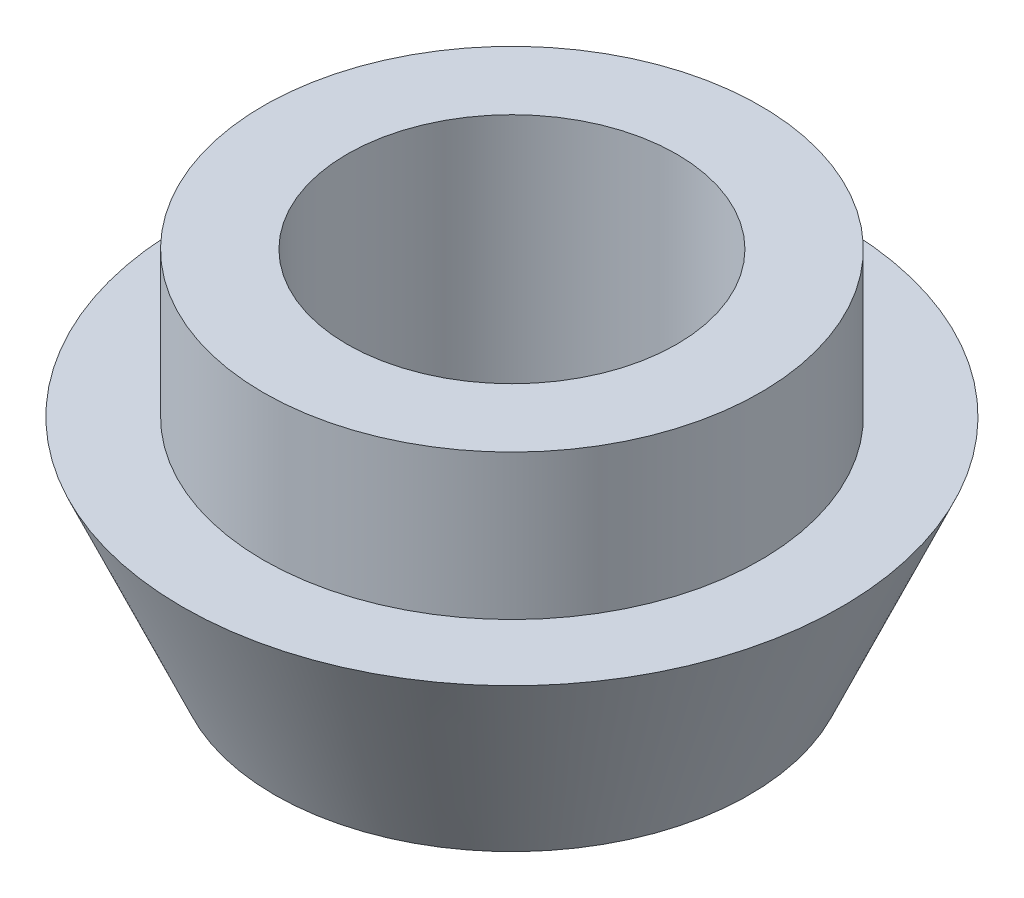
ISO-10303-21;
HEADER;
FILE_DESCRIPTION(('STEP AP214'),'2;1');
FILE_NAME('part.step','',(''),(''),'','','');
FILE_SCHEMA(('AUTOMOTIVE_DESIGN { 1 0 10303 214 1 1 1 1 }'));
ENDSEC;
DATA;
#1=APPLICATION_CONTEXT('core data for automotive mechanical design processes');
#2=APPLICATION_PROTOCOL_DEFINITION('international standard','automotive_design',2000,#1);
#3=PRODUCT_CONTEXT('',#1,'mechanical');
#4=PRODUCT('Part','Part','',(#3));
#5=PRODUCT_RELATED_PRODUCT_CATEGORY('part','',(#4));
#6=PRODUCT_DEFINITION_FORMATION('','',#4);
#7=PRODUCT_DEFINITION_CONTEXT('part definition',#1,'design');
#8=PRODUCT_DEFINITION('design','',#6,#7);
#9=PRODUCT_DEFINITION_SHAPE('','',#8);
#10=(LENGTH_UNIT() NAMED_UNIT(*) SI_UNIT(.MILLI.,.METRE.));
#11=(NAMED_UNIT(*) PLANE_ANGLE_UNIT() SI_UNIT($,.RADIAN.));
#12=(NAMED_UNIT(*) SI_UNIT($,.STERADIAN.) SOLID_ANGLE_UNIT());
#13=UNCERTAINTY_MEASURE_WITH_UNIT(LENGTH_MEASURE(1.E-05),#10,'distance_accuracy_value','');
#14=(GEOMETRIC_REPRESENTATION_CONTEXT(3) GLOBAL_UNCERTAINTY_ASSIGNED_CONTEXT((#13)) GLOBAL_UNIT_ASSIGNED_CONTEXT((#10,
#11,#12)) REPRESENTATION_CONTEXT('',''));
#15=CARTESIAN_POINT('',(0.,0.,0.));
#16=DIRECTION('',(0.,0.,1.));
#17=DIRECTION('',(1.,0.,0.));
#18=AXIS2_PLACEMENT_3D('',#15,#16,#17);
#19=CARTESIAN_POINT('',(4.572,0.,0.));
#20=DIRECTION('',(0.,-1.,0.));
#21=DIRECTION('',(0.,0.,1.));
#22=AXIS2_PLACEMENT_3D('',#19,#20,#21);
#23=PLANE('',#22);
#24=CARTESIAN_POINT('',(0.,0.,0.));
#25=DIRECTION('',(0.,1.,0.));
#26=DIRECTION('',(0.,0.,1.));
#27=AXIS2_PLACEMENT_3D('',#24,#25,#26);
#28=CIRCLE('',#27,4.572);
#29=CARTESIAN_POINT('',(0.,0.,4.572));
#30=VERTEX_POINT('',#29);
#31=EDGE_CURVE('E52',#30,#30,#28,.T.);
#32=ORIENTED_EDGE('',*,*,#31,.F.);
#33=EDGE_LOOP('',(#32));
#34=FACE_BOUND('',#33,.T.);
#35=CARTESIAN_POINT('',(0.,0.,0.));
#36=DIRECTION('',(0.,1.,0.));
#37=DIRECTION('',(0.,0.,1.));
#38=AXIS2_PLACEMENT_3D('',#35,#36,#37);
#39=CIRCLE('',#38,3.175);
#40=CARTESIAN_POINT('',(0.,0.,3.175));
#41=VERTEX_POINT('',#40);
#42=EDGE_CURVE('E10',#41,#41,#39,.T.);
#43=ORIENTED_EDGE('',*,*,#42,.T.);
#44=EDGE_LOOP('',(#43));
#45=FACE_BOUND('',#44,.T.);
#46=ADVANCED_FACE('F30',(#34,#45),#23,.T.);
#47=CARTESIAN_POINT('',(0.,-15.0878609773988,0.));
#48=DIRECTION('',(0.,-1.,0.));
#49=DIRECTION('',(0.,0.,1.));
#50=AXIS2_PLACEMENT_3D('',#47,#48,#49);
#51=CYLINDRICAL_SURFACE('',#50,3.175);
#52=ORIENTED_EDGE('',*,*,#42,.F.);
#53=EDGE_LOOP('',(#52));
#54=FACE_BOUND('',#53,.T.);
#55=CARTESIAN_POINT('',(0.,6.8199,0.));
#56=DIRECTION('',(0.,1.,0.));
#57=DIRECTION('',(0.,0.,1.));
#58=AXIS2_PLACEMENT_3D('',#55,#56,#57);
#59=CIRCLE('',#58,3.175);
#60=CARTESIAN_POINT('',(0.,6.8199,3.175));
#61=VERTEX_POINT('',#60);
#62=EDGE_CURVE('E36',#61,#61,#59,.T.);
#63=ORIENTED_EDGE('',*,*,#62,.T.);
#64=EDGE_LOOP('',(#63));
#65=FACE_BOUND('',#64,.T.);
#66=ADVANCED_FACE('F59',(#54,#65),#51,.F.);
#67=CARTESIAN_POINT('',(3.96875,6.8199,0.));
#68=DIRECTION('',(0.,1.,0.));
#69=DIRECTION('',(0.,0.,-1.));
#70=AXIS2_PLACEMENT_3D('',#67,#68,#69);
#71=PLANE('',#70);
#72=ORIENTED_EDGE('',*,*,#62,.F.);
#73=EDGE_LOOP('',(#72));
#74=FACE_BOUND('',#73,.T.);
#75=CARTESIAN_POINT('',(0.,6.8199,0.));
#76=DIRECTION('',(0.,1.,0.));
#77=DIRECTION('',(0.,0.,1.));
#78=AXIS2_PLACEMENT_3D('',#75,#76,#77);
#79=CIRCLE('',#78,4.7879);
#80=CARTESIAN_POINT('',(0.,6.8199,4.7879));
#81=VERTEX_POINT('',#80);
#82=EDGE_CURVE('E40',#81,#81,#79,.T.);
#83=ORIENTED_EDGE('',*,*,#82,.T.);
#84=EDGE_LOOP('',(#83));
#85=FACE_BOUND('',#84,.T.);
#86=ADVANCED_FACE('F63',(#74,#85),#71,.T.);
#87=CARTESIAN_POINT('',(0.,-15.0878609773988,0.));
#88=DIRECTION('',(0.,-1.,0.));
#89=DIRECTION('',(0.,0.,1.));
#90=AXIS2_PLACEMENT_3D('',#87,#88,#89);
#91=CYLINDRICAL_SURFACE('',#90,4.7879);
#92=ORIENTED_EDGE('',*,*,#82,.F.);
#93=EDGE_LOOP('',(#92));
#94=FACE_BOUND('',#93,.T.);
#95=CARTESIAN_POINT('',(0.,4.0259,0.));
#96=DIRECTION('',(0.,1.,0.));
#97=DIRECTION('',(0.,0.,1.));
#98=AXIS2_PLACEMENT_3D('',#95,#96,#97);
#99=CIRCLE('',#98,4.7879);
#100=CARTESIAN_POINT('',(0.,4.0259,4.7879));
#101=VERTEX_POINT('',#100);
#102=EDGE_CURVE('E44',#101,#101,#99,.T.);
#103=ORIENTED_EDGE('',*,*,#102,.T.);
#104=EDGE_LOOP('',(#103));
#105=FACE_BOUND('',#104,.T.);
#106=ADVANCED_FACE('F68',(#94,#105),#91,.T.);
#107=CARTESIAN_POINT('',(4.7879,4.0259,0.));
#108=DIRECTION('',(0.,1.,0.));
#109=DIRECTION('',(0.,0.,-1.));
#110=AXIS2_PLACEMENT_3D('',#107,#108,#109);
#111=PLANE('',#110);
#112=ORIENTED_EDGE('',*,*,#102,.F.);
#113=EDGE_LOOP('',(#112));
#114=FACE_BOUND('',#113,.T.);
#115=CARTESIAN_POINT('',(0.,4.0259,0.));
#116=DIRECTION('',(0.,1.,0.));
#117=DIRECTION('',(0.,0.,1.));
#118=AXIS2_PLACEMENT_3D('',#115,#116,#117);
#119=CIRCLE('',#118,6.35);
#120=CARTESIAN_POINT('',(0.,4.0259,6.35));
#121=VERTEX_POINT('',#120);
#122=EDGE_CURVE('E49',#121,#121,#119,.T.);
#123=ORIENTED_EDGE('',*,*,#122,.T.);
#124=EDGE_LOOP('',(#123));
#125=FACE_BOUND('',#124,.T.);
#126=ADVANCED_FACE('F74',(#114,#125),#111,.T.);
#127=CARTESIAN_POINT('',(0.,0.,0.));
#128=DIRECTION('',(0.,1.,0.));
#129=DIRECTION('',(0.,0.,-1.));
#130=AXIS2_PLACEMENT_3D('',#127,#128,#129);
#131=CONICAL_SURFACE('',#130,4.572,0.415880354967817);
#132=ORIENTED_EDGE('',*,*,#122,.F.);
#133=EDGE_LOOP('',(#132));
#134=FACE_BOUND('',#133,.T.);
#135=ORIENTED_EDGE('',*,*,#31,.T.);
#136=EDGE_LOOP('',(#135));
#137=FACE_BOUND('',#136,.T.);
#138=ADVANCED_FACE('F56',(#134,#137),#131,.T.);
#139=CLOSED_SHELL('',(#46,#66,#86,#106,#126,#138));
#140=MANIFOLD_SOLID_BREP('B2',#139);
#141=ADVANCED_BREP_SHAPE_REPRESENTATION('',(#18,#140),#14);
#142=SHAPE_DEFINITION_REPRESENTATION(#9,#141);
ENDSEC;
END-ISO-10303-21;
